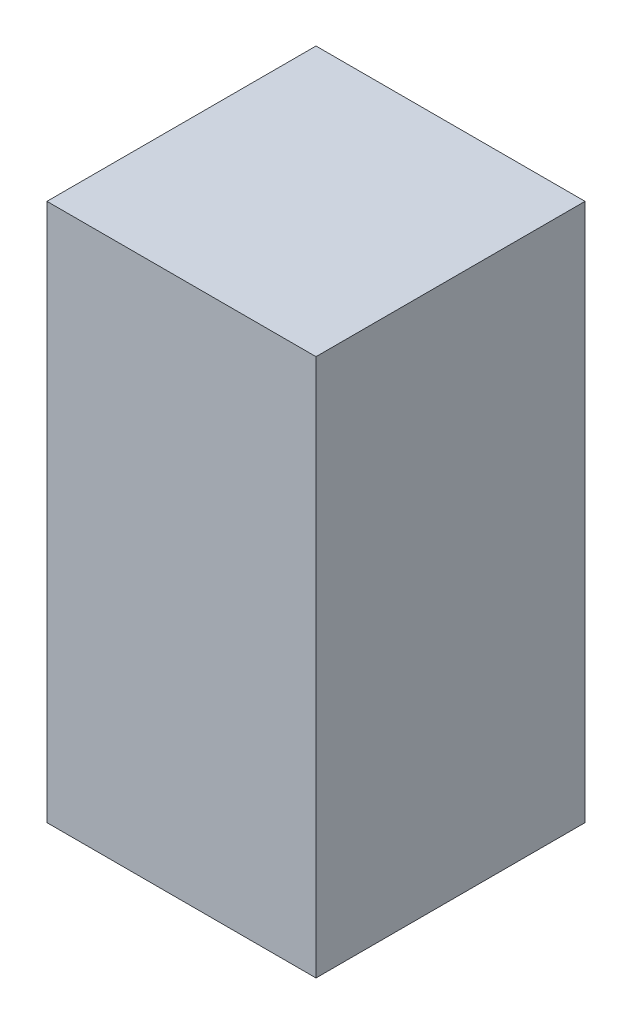
ISO-10303-21;
HEADER;
FILE_DESCRIPTION(('STEP AP214'),'2;1');
FILE_NAME('part.step','',(''),(''),'','','');
FILE_SCHEMA(('AUTOMOTIVE_DESIGN { 1 0 10303 214 1 1 1 1 }'));
ENDSEC;
DATA;
#1=APPLICATION_CONTEXT('core data for automotive mechanical design processes');
#2=APPLICATION_PROTOCOL_DEFINITION('international standard','automotive_design',2000,#1);
#3=PRODUCT_CONTEXT('',#1,'mechanical');
#4=PRODUCT('Part','Part','',(#3));
#5=PRODUCT_RELATED_PRODUCT_CATEGORY('part','',(#4));
#6=PRODUCT_DEFINITION_FORMATION('','',#4);
#7=PRODUCT_DEFINITION_CONTEXT('part definition',#1,'design');
#8=PRODUCT_DEFINITION('design','',#6,#7);
#9=PRODUCT_DEFINITION_SHAPE('','',#8);
#10=(LENGTH_UNIT() NAMED_UNIT(*) SI_UNIT(.MILLI.,.METRE.));
#11=(NAMED_UNIT(*) PLANE_ANGLE_UNIT() SI_UNIT($,.RADIAN.));
#12=(NAMED_UNIT(*) SI_UNIT($,.STERADIAN.) SOLID_ANGLE_UNIT());
#13=UNCERTAINTY_MEASURE_WITH_UNIT(LENGTH_MEASURE(1.E-05),#10,'distance_accuracy_value','');
#14=(GEOMETRIC_REPRESENTATION_CONTEXT(3) GLOBAL_UNCERTAINTY_ASSIGNED_CONTEXT((#13)) GLOBAL_UNIT_ASSIGNED_CONTEXT((#10,
#11,#12)) REPRESENTATION_CONTEXT('',''));
#15=CARTESIAN_POINT('',(0.,0.,0.));
#16=DIRECTION('',(0.,0.,1.));
#17=DIRECTION('',(1.,0.,0.));
#18=AXIS2_PLACEMENT_3D('',#15,#16,#17);
#19=CARTESIAN_POINT('',(-25.4,101.6,-25.4));
#20=DIRECTION('',(1.,0.,0.));
#21=DIRECTION('',(0.,0.,-1.));
#22=AXIS2_PLACEMENT_3D('',#19,#20,#21);
#23=PLANE('',#22);
#24=DIRECTION('',(0.,0.,1.));
#25=VECTOR('',#24,1.);
#26=CARTESIAN_POINT('',(-25.4,0.,-25.4));
#27=LINE('',#26,#25);
#28=CARTESIAN_POINT('',(-25.4,0.,-25.4));
#29=VERTEX_POINT('',#28);
#30=CARTESIAN_POINT('',(-25.4,0.,25.4));
#31=VERTEX_POINT('',#30);
#32=EDGE_CURVE('E96',#29,#31,#27,.T.);
#33=ORIENTED_EDGE('',*,*,#32,.T.);
#34=DIRECTION('',(0.,-1.,0.));
#35=VECTOR('',#34,1.);
#36=CARTESIAN_POINT('',(-25.4,101.6,25.4));
#37=LINE('',#36,#35);
#38=CARTESIAN_POINT('',(-25.4,101.6,25.4));
#39=VERTEX_POINT('',#38);
#40=EDGE_CURVE('E11',#39,#31,#37,.T.);
#41=ORIENTED_EDGE('',*,*,#40,.F.);
#42=DIRECTION('',(0.,0.,1.));
#43=VECTOR('',#42,1.);
#44=CARTESIAN_POINT('',(-25.4,101.6,-25.4));
#45=LINE('',#44,#43);
#46=CARTESIAN_POINT('',(-25.4,101.6,-25.4));
#47=VERTEX_POINT('',#46);
#48=EDGE_CURVE('E84',#47,#39,#45,.T.);
#49=ORIENTED_EDGE('',*,*,#48,.F.);
#50=DIRECTION('',(0.,-1.,0.));
#51=VECTOR('',#50,1.);
#52=CARTESIAN_POINT('',(-25.4,101.6,-25.4));
#53=LINE('',#52,#51);
#54=EDGE_CURVE('E92',#47,#29,#53,.T.);
#55=ORIENTED_EDGE('',*,*,#54,.T.);
#56=EDGE_LOOP('',(#33,#41,#49,#55));
#57=FACE_BOUND('',#56,.T.);
#58=ADVANCED_FACE('F33',(#57),#23,.F.);
#59=CARTESIAN_POINT('',(25.4,101.6,25.4));
#60=DIRECTION('',(0.,0.,-1.));
#61=DIRECTION('',(-1.,0.,0.));
#62=AXIS2_PLACEMENT_3D('',#59,#60,#61);
#63=PLANE('',#62);
#64=DIRECTION('',(1.,0.,0.));
#65=VECTOR('',#64,1.);
#66=CARTESIAN_POINT('',(25.4,0.,25.4));
#67=LINE('',#66,#65);
#68=CARTESIAN_POINT('',(25.4,0.,25.4));
#69=VERTEX_POINT('',#68);
#70=EDGE_CURVE('E88',#31,#69,#67,.T.);
#71=ORIENTED_EDGE('',*,*,#70,.T.);
#72=DIRECTION('',(0.,-1.,0.));
#73=VECTOR('',#72,1.);
#74=CARTESIAN_POINT('',(25.4,101.6,25.4));
#75=LINE('',#74,#73);
#76=CARTESIAN_POINT('',(25.4,101.6,25.4));
#77=VERTEX_POINT('',#76);
#78=EDGE_CURVE('E41',#77,#69,#75,.T.);
#79=ORIENTED_EDGE('',*,*,#78,.F.);
#80=DIRECTION('',(1.,0.,0.));
#81=VECTOR('',#80,1.);
#82=CARTESIAN_POINT('',(25.4,101.6,25.4));
#83=LINE('',#82,#81);
#84=EDGE_CURVE('E79',#39,#77,#83,.T.);
#85=ORIENTED_EDGE('',*,*,#84,.F.);
#86=ORIENTED_EDGE('',*,*,#40,.T.);
#87=EDGE_LOOP('',(#71,#79,#85,#86));
#88=FACE_BOUND('',#87,.T.);
#89=ADVANCED_FACE('F87',(#88),#63,.F.);
#90=CARTESIAN_POINT('',(25.4,101.6,-25.4));
#91=DIRECTION('',(-1.,0.,0.));
#92=DIRECTION('',(0.,0.,1.));
#93=AXIS2_PLACEMENT_3D('',#90,#91,#92);
#94=PLANE('',#93);
#95=DIRECTION('',(0.,0.,-1.));
#96=VECTOR('',#95,1.);
#97=CARTESIAN_POINT('',(25.4,0.,-25.4));
#98=LINE('',#97,#96);
#99=CARTESIAN_POINT('',(25.4,0.,-25.4));
#100=VERTEX_POINT('',#99);
#101=EDGE_CURVE('E66',#69,#100,#98,.T.);
#102=ORIENTED_EDGE('',*,*,#101,.T.);
#103=DIRECTION('',(0.,-1.,0.));
#104=VECTOR('',#103,1.);
#105=CARTESIAN_POINT('',(25.4,101.6,-25.4));
#106=LINE('',#105,#104);
#107=CARTESIAN_POINT('',(25.4,101.6,-25.4));
#108=VERTEX_POINT('',#107);
#109=EDGE_CURVE('E89',#108,#100,#106,.T.);
#110=ORIENTED_EDGE('',*,*,#109,.F.);
#111=DIRECTION('',(0.,0.,-1.));
#112=VECTOR('',#111,1.);
#113=CARTESIAN_POINT('',(25.4,101.6,-25.4));
#114=LINE('',#113,#112);
#115=EDGE_CURVE('E82',#77,#108,#114,.T.);
#116=ORIENTED_EDGE('',*,*,#115,.F.);
#117=ORIENTED_EDGE('',*,*,#78,.T.);
#118=EDGE_LOOP('',(#102,#110,#116,#117));
#119=FACE_BOUND('',#118,.T.);
#120=ADVANCED_FACE('F90',(#119),#94,.F.);
#121=CARTESIAN_POINT('',(25.4,101.6,-25.4));
#122=DIRECTION('',(0.,0.,1.));
#123=DIRECTION('',(1.,0.,0.));
#124=AXIS2_PLACEMENT_3D('',#121,#122,#123);
#125=PLANE('',#124);
#126=DIRECTION('',(-1.,0.,0.));
#127=VECTOR('',#126,1.);
#128=CARTESIAN_POINT('',(25.4,0.,-25.4));
#129=LINE('',#128,#127);
#130=EDGE_CURVE('E72',#100,#29,#129,.T.);
#131=ORIENTED_EDGE('',*,*,#130,.T.);
#132=ORIENTED_EDGE('',*,*,#54,.F.);
#133=DIRECTION('',(-1.,0.,0.));
#134=VECTOR('',#133,1.);
#135=CARTESIAN_POINT('',(25.4,101.6,-25.4));
#136=LINE('',#135,#134);
#137=EDGE_CURVE('E49',#108,#47,#136,.T.);
#138=ORIENTED_EDGE('',*,*,#137,.F.);
#139=ORIENTED_EDGE('',*,*,#109,.T.);
#140=EDGE_LOOP('',(#131,#132,#138,#139));
#141=FACE_BOUND('',#140,.T.);
#142=ADVANCED_FACE('F103',(#141),#125,.F.);
#143=CARTESIAN_POINT('',(0.,101.6,0.));
#144=DIRECTION('',(0.,-1.,0.));
#145=DIRECTION('',(0.,0.,-1.));
#146=AXIS2_PLACEMENT_3D('',#143,#144,#145);
#147=PLANE('',#146);
#148=ORIENTED_EDGE('',*,*,#48,.T.);
#149=ORIENTED_EDGE('',*,*,#84,.T.);
#150=ORIENTED_EDGE('',*,*,#115,.T.);
#151=ORIENTED_EDGE('',*,*,#137,.T.);
#152=EDGE_LOOP('',(#148,#149,#150,#151));
#153=FACE_BOUND('',#152,.T.);
#154=ADVANCED_FACE('F80',(#153),#147,.F.);
#155=CARTESIAN_POINT('',(0.,0.,0.));
#156=DIRECTION('',(0.,-1.,0.));
#157=DIRECTION('',(0.,0.,-1.));
#158=AXIS2_PLACEMENT_3D('',#155,#156,#157);
#159=PLANE('',#158);
#160=ORIENTED_EDGE('',*,*,#32,.F.);
#161=ORIENTED_EDGE('',*,*,#130,.F.);
#162=ORIENTED_EDGE('',*,*,#101,.F.);
#163=ORIENTED_EDGE('',*,*,#70,.F.);
#164=EDGE_LOOP('',(#160,#161,#162,#163));
#165=FACE_BOUND('',#164,.T.);
#166=ADVANCED_FACE('F106',(#165),#159,.T.);
#167=CLOSED_SHELL('',(#58,#89,#120,#142,#154,#166));
#168=MANIFOLD_SOLID_BREP('B2',#167);
#169=ADVANCED_BREP_SHAPE_REPRESENTATION('',(#18,#168),#14);
#170=SHAPE_DEFINITION_REPRESENTATION(#9,#169);
ENDSEC;
END-ISO-10303-21;
